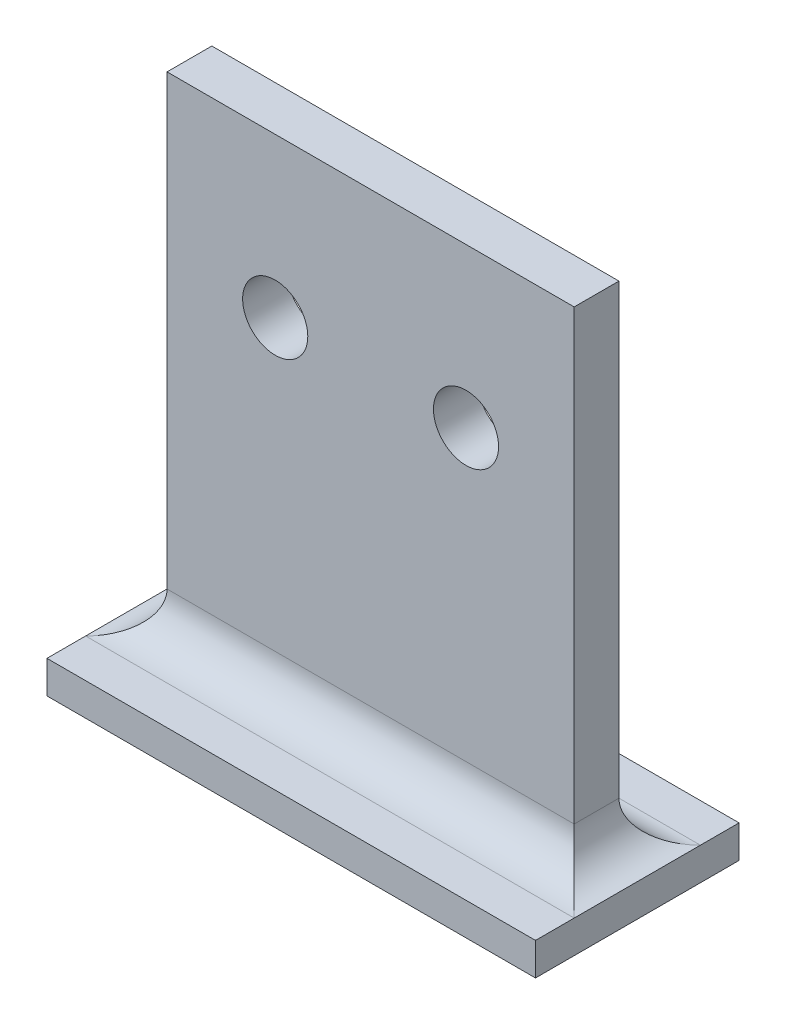
ISO-10303-21;
HEADER;
FILE_DESCRIPTION(('STEP AP214'),'2;1');
FILE_NAME('part.step','',(''),(''),'','','');
FILE_SCHEMA(('AUTOMOTIVE_DESIGN { 1 0 10303 214 1 1 1 1 }'));
ENDSEC;
DATA;
#1=APPLICATION_CONTEXT('core data for automotive mechanical design processes');
#2=APPLICATION_PROTOCOL_DEFINITION('international standard','automotive_design',2000,#1);
#3=PRODUCT_CONTEXT('',#1,'mechanical');
#4=PRODUCT('Part','Part','',(#3));
#5=PRODUCT_RELATED_PRODUCT_CATEGORY('part','',(#4));
#6=PRODUCT_DEFINITION_FORMATION('','',#4);
#7=PRODUCT_DEFINITION_CONTEXT('part definition',#1,'design');
#8=PRODUCT_DEFINITION('design','',#6,#7);
#9=PRODUCT_DEFINITION_SHAPE('','',#8);
#10=(LENGTH_UNIT() NAMED_UNIT(*) SI_UNIT(.MILLI.,.METRE.));
#11=(NAMED_UNIT(*) PLANE_ANGLE_UNIT() SI_UNIT($,.RADIAN.));
#12=(NAMED_UNIT(*) SI_UNIT($,.STERADIAN.) SOLID_ANGLE_UNIT());
#13=UNCERTAINTY_MEASURE_WITH_UNIT(LENGTH_MEASURE(1.E-05),#10,'distance_accuracy_value','');
#14=(GEOMETRIC_REPRESENTATION_CONTEXT(3) GLOBAL_UNCERTAINTY_ASSIGNED_CONTEXT((#13)) GLOBAL_UNIT_ASSIGNED_CONTEXT((#10,
#11,#12)) REPRESENTATION_CONTEXT('',''));
#15=CARTESIAN_POINT('',(0.,0.,0.));
#16=DIRECTION('',(0.,0.,1.));
#17=DIRECTION('',(1.,0.,0.));
#18=AXIS2_PLACEMENT_3D('',#15,#16,#17);
#19=CARTESIAN_POINT('',(-25.,62.8071570576541,9.75));
#20=DIRECTION('',(0.,0.,1.));
#21=DIRECTION('',(1.,0.,0.));
#22=AXIS2_PLACEMENT_3D('',#19,#20,#21);
#23=PLANE('',#22);
#24=DIRECTION('',(0.,-1.,0.));
#25=VECTOR('',#24,1.);
#26=CARTESIAN_POINT('',(25.,62.8071570576541,9.75));
#27=LINE('',#26,#25);
#28=CARTESIAN_POINT('',(25.,62.8071570576541,9.75));
#29=VERTEX_POINT('',#28);
#30=CARTESIAN_POINT('',(25.,7.80715705765408,9.75));
#31=VERTEX_POINT('',#30);
#32=EDGE_CURVE('E117',#29,#31,#27,.T.);
#33=ORIENTED_EDGE('',*,*,#32,.T.);
#34=DIRECTION('',(-1.,0.,0.));
#35=VECTOR('',#34,1.);
#36=CARTESIAN_POINT('',(-25.,7.80715705765408,9.75));
#37=LINE('',#36,#35);
#38=CARTESIAN_POINT('',(-25.,7.80715705765408,9.75));
#39=VERTEX_POINT('',#38);
#40=EDGE_CURVE('E175',#31,#39,#37,.T.);
#41=ORIENTED_EDGE('',*,*,#40,.T.);
#42=DIRECTION('',(0.,-1.,0.));
#43=VECTOR('',#42,1.);
#44=CARTESIAN_POINT('',(-25.,62.8071570576541,9.75));
#45=LINE('',#44,#43);
#46=CARTESIAN_POINT('',(-25.,62.8071570576541,9.75));
#47=VERTEX_POINT('',#46);
#48=EDGE_CURVE('E119',#47,#39,#45,.T.);
#49=ORIENTED_EDGE('',*,*,#48,.F.);
#50=DIRECTION('',(-1.,0.,0.));
#51=VECTOR('',#50,1.);
#52=CARTESIAN_POINT('',(-25.,62.8071570576541,9.75));
#53=LINE('',#52,#51);
#54=EDGE_CURVE('E112',#29,#47,#53,.T.);
#55=ORIENTED_EDGE('',*,*,#54,.F.);
#56=EDGE_LOOP('',(#33,#41,#49,#55));
#57=FACE_BOUND('',#56,.T.);
#58=CARTESIAN_POINT('',(11.715,43.3071570576541,9.75));
#59=DIRECTION('',(0.,0.,1.));
#60=DIRECTION('',(1.,0.,0.));
#61=AXIS2_PLACEMENT_3D('',#58,#59,#60);
#62=CIRCLE('',#61,4.);
#63=CARTESIAN_POINT('',(15.715,43.3071570576541,9.75));
#64=VERTEX_POINT('',#63);
#65=EDGE_CURVE('E312',#64,#64,#62,.F.);
#66=ORIENTED_EDGE('',*,*,#65,.F.);
#67=EDGE_LOOP('',(#66));
#68=FACE_BOUND('',#67,.T.);
#69=CARTESIAN_POINT('',(-11.715,43.3071570576541,9.75));
#70=DIRECTION('',(0.,0.,1.));
#71=DIRECTION('',(1.,0.,0.));
#72=AXIS2_PLACEMENT_3D('',#69,#70,#71);
#73=CIRCLE('',#72,4.);
#74=CARTESIAN_POINT('',(-7.71499999999999,43.3071570576541,9.75));
#75=VERTEX_POINT('',#74);
#76=EDGE_CURVE('E187',#75,#75,#73,.T.);
#77=ORIENTED_EDGE('',*,*,#76,.T.);
#78=EDGE_LOOP('',(#77));
#79=FACE_BOUND('',#78,.T.);
#80=ADVANCED_FACE('F33',(#57,#68,#79),#23,.F.);
#81=CARTESIAN_POINT('',(-25.,62.8071570576541,15.25));
#82=DIRECTION('',(0.,0.,-1.));
#83=DIRECTION('',(-1.,0.,0.));
#84=AXIS2_PLACEMENT_3D('',#81,#82,#83);
#85=PLANE('',#84);
#86=DIRECTION('',(0.,-1.,0.));
#87=VECTOR('',#86,1.);
#88=CARTESIAN_POINT('',(-25.,62.8071570576541,15.25));
#89=LINE('',#88,#87);
#90=CARTESIAN_POINT('',(-25.,62.8071570576541,15.25));
#91=VERTEX_POINT('',#90);
#92=CARTESIAN_POINT('',(-25.,7.80715705765408,15.25));
#93=VERTEX_POINT('',#92);
#94=EDGE_CURVE('E139',#91,#93,#89,.T.);
#95=ORIENTED_EDGE('',*,*,#94,.T.);
#96=DIRECTION('',(1.,0.,0.));
#97=VECTOR('',#96,1.);
#98=CARTESIAN_POINT('',(25.,7.80715705765408,15.25));
#99=LINE('',#98,#97);
#100=CARTESIAN_POINT('',(25.,7.80715705765408,15.25));
#101=VERTEX_POINT('',#100);
#102=EDGE_CURVE('E11',#93,#101,#99,.T.);
#103=ORIENTED_EDGE('',*,*,#102,.T.);
#104=DIRECTION('',(0.,-1.,0.));
#105=VECTOR('',#104,1.);
#106=CARTESIAN_POINT('',(25.,62.8071570576541,15.25));
#107=LINE('',#106,#105);
#108=CARTESIAN_POINT('',(25.,62.8071570576541,15.25));
#109=VERTEX_POINT('',#108);
#110=EDGE_CURVE('E302',#109,#101,#107,.T.);
#111=ORIENTED_EDGE('',*,*,#110,.F.);
#112=DIRECTION('',(1.,0.,0.));
#113=VECTOR('',#112,1.);
#114=CARTESIAN_POINT('',(-25.,62.8071570576541,15.25));
#115=LINE('',#114,#113);
#116=EDGE_CURVE('E128',#91,#109,#115,.T.);
#117=ORIENTED_EDGE('',*,*,#116,.F.);
#118=EDGE_LOOP('',(#95,#103,#111,#117));
#119=FACE_BOUND('',#118,.T.);
#120=CARTESIAN_POINT('',(11.715,43.3071570576541,15.25));
#121=DIRECTION('',(0.,0.,1.));
#122=DIRECTION('',(1.,0.,0.));
#123=AXIS2_PLACEMENT_3D('',#120,#121,#122);
#124=CIRCLE('',#123,4.);
#125=CARTESIAN_POINT('',(15.715,43.3071570576541,15.25));
#126=VERTEX_POINT('',#125);
#127=EDGE_CURVE('E309',#126,#126,#124,.F.);
#128=ORIENTED_EDGE('',*,*,#127,.T.);
#129=EDGE_LOOP('',(#128));
#130=FACE_BOUND('',#129,.T.);
#131=CARTESIAN_POINT('',(-11.715,43.3071570576541,15.25));
#132=DIRECTION('',(0.,0.,1.));
#133=DIRECTION('',(1.,0.,0.));
#134=AXIS2_PLACEMENT_3D('',#131,#132,#133);
#135=CIRCLE('',#134,4.);
#136=CARTESIAN_POINT('',(-7.71499999999999,43.3071570576541,15.25));
#137=VERTEX_POINT('',#136);
#138=EDGE_CURVE('E311',#137,#137,#135,.T.);
#139=ORIENTED_EDGE('',*,*,#138,.F.);
#140=EDGE_LOOP('',(#139));
#141=FACE_BOUND('',#140,.T.);
#142=ADVANCED_FACE('F236',(#119,#130,#141),#85,.F.);
#143=CARTESIAN_POINT('',(30.,2.80715705765408,25.));
#144=DIRECTION('',(0.,-1.,0.));
#145=DIRECTION('',(0.,0.,-1.));
#146=AXIS2_PLACEMENT_3D('',#143,#144,#145);
#147=PLANE('',#146);
#148=DIRECTION('',(0.,0.,-1.));
#149=VECTOR('',#148,1.);
#150=CARTESIAN_POINT('',(-30.,2.80715705765408,25.));
#151=LINE('',#150,#149);
#152=CARTESIAN_POINT('',(-30.,2.80715705765408,4.75));
#153=VERTEX_POINT('',#152);
#154=CARTESIAN_POINT('',(-30.,2.80715705765408,0.));
#155=VERTEX_POINT('',#154);
#156=EDGE_CURVE('E152',#153,#155,#151,.T.);
#157=ORIENTED_EDGE('',*,*,#156,.F.);
#158=DIRECTION('',(-1.,0.,0.));
#159=VECTOR('',#158,1.);
#160=CARTESIAN_POINT('',(25.,2.80715705765408,4.75));
#161=LINE('',#160,#159);
#162=CARTESIAN_POINT('',(30.,2.80715705765408,4.75));
#163=VERTEX_POINT('',#162);
#164=EDGE_CURVE('E179',#153,#163,#161,.F.);
#165=ORIENTED_EDGE('',*,*,#164,.T.);
#166=DIRECTION('',(0.,0.,-1.));
#167=VECTOR('',#166,1.);
#168=CARTESIAN_POINT('',(30.,2.80715705765408,25.));
#169=LINE('',#168,#167);
#170=CARTESIAN_POINT('',(30.,2.80715705765408,0.));
#171=VERTEX_POINT('',#170);
#172=EDGE_CURVE('E163',#163,#171,#169,.T.);
#173=ORIENTED_EDGE('',*,*,#172,.T.);
#174=DIRECTION('',(-1.,0.,0.));
#175=VECTOR('',#174,1.);
#176=CARTESIAN_POINT('',(30.,2.80715705765408,0.));
#177=LINE('',#176,#175);
#178=EDGE_CURVE('E147',#171,#155,#177,.T.);
#179=ORIENTED_EDGE('',*,*,#178,.T.);
#180=EDGE_LOOP('',(#157,#165,#173,#179));
#181=FACE_BOUND('',#180,.T.);
#182=ADVANCED_FACE('F219',(#181),#147,.F.);
#183=CARTESIAN_POINT('',(30.,2.80715705765408,25.));
#184=VERTEX_POINT('',#183);
#185=CARTESIAN_POINT('',(30.,2.80715705765408,20.25));
#186=VERTEX_POINT('',#185);
#187=EDGE_CURVE('E165',#184,#186,#169,.T.);
#188=ORIENTED_EDGE('',*,*,#187,.T.);
#189=DIRECTION('',(1.,0.,0.));
#190=VECTOR('',#189,1.);
#191=CARTESIAN_POINT('',(-25.,2.80715705765408,20.25));
#192=LINE('',#191,#190);
#193=CARTESIAN_POINT('',(-30.,2.80715705765408,20.25));
#194=VERTEX_POINT('',#193);
#195=EDGE_CURVE('E177',#186,#194,#192,.F.);
#196=ORIENTED_EDGE('',*,*,#195,.T.);
#197=CARTESIAN_POINT('',(-30.,2.80715705765408,25.));
#198=VERTEX_POINT('',#197);
#199=EDGE_CURVE('E160',#198,#194,#151,.T.);
#200=ORIENTED_EDGE('',*,*,#199,.F.);
#201=DIRECTION('',(-1.,0.,0.));
#202=VECTOR('',#201,1.);
#203=CARTESIAN_POINT('',(30.,2.80715705765408,25.));
#204=LINE('',#203,#202);
#205=EDGE_CURVE('E151',#184,#198,#204,.T.);
#206=ORIENTED_EDGE('',*,*,#205,.F.);
#207=EDGE_LOOP('',(#188,#196,#200,#206));
#208=FACE_BOUND('',#207,.T.);
#209=ADVANCED_FACE('F202',(#208),#147,.F.);
#210=CARTESIAN_POINT('',(-30.,-1.19284294234592,25.));
#211=DIRECTION('',(1.,0.,0.));
#212=DIRECTION('',(0.,0.,-1.));
#213=AXIS2_PLACEMENT_3D('',#210,#211,#212);
#214=PLANE('',#213);
#215=DIRECTION('',(0.,-1.,0.));
#216=VECTOR('',#215,1.);
#217=CARTESIAN_POINT('',(-30.,-1.19284294234592,0.));
#218=LINE('',#217,#216);
#219=CARTESIAN_POINT('',(-30.,-1.19284294234592,0.));
#220=VERTEX_POINT('',#219);
#221=EDGE_CURVE('E134',#155,#220,#218,.T.);
#222=ORIENTED_EDGE('',*,*,#221,.T.);
#223=DIRECTION('',(0.,0.,-1.));
#224=VECTOR('',#223,1.);
#225=CARTESIAN_POINT('',(-30.,-1.19284294234592,25.));
#226=LINE('',#225,#224);
#227=CARTESIAN_POINT('',(-30.,-1.19284294234592,25.));
#228=VERTEX_POINT('',#227);
#229=EDGE_CURVE('E172',#228,#220,#226,.T.);
#230=ORIENTED_EDGE('',*,*,#229,.F.);
#231=DIRECTION('',(0.,-1.,0.));
#232=VECTOR('',#231,1.);
#233=CARTESIAN_POINT('',(-30.,-1.19284294234592,25.));
#234=LINE('',#233,#232);
#235=EDGE_CURVE('E143',#198,#228,#234,.T.);
#236=ORIENTED_EDGE('',*,*,#235,.F.);
#237=ORIENTED_EDGE('',*,*,#199,.T.);
#238=EDGE_CURVE('E164',#194,#153,#151,.T.);
#239=ORIENTED_EDGE('',*,*,#238,.T.);
#240=ORIENTED_EDGE('',*,*,#156,.T.);
#241=EDGE_LOOP('',(#222,#230,#236,#237,#239,#240));
#242=FACE_BOUND('',#241,.T.);
#243=ADVANCED_FACE('F208',(#242),#214,.F.);
#244=CARTESIAN_POINT('',(30.,-1.19284294234592,25.));
#245=DIRECTION('',(0.,1.,0.));
#246=DIRECTION('',(0.,0.,1.));
#247=AXIS2_PLACEMENT_3D('',#244,#245,#246);
#248=PLANE('',#247);
#249=DIRECTION('',(1.,0.,0.));
#250=VECTOR('',#249,1.);
#251=CARTESIAN_POINT('',(30.,-1.19284294234592,0.));
#252=LINE('',#251,#250);
#253=CARTESIAN_POINT('',(30.,-1.19284294234592,0.));
#254=VERTEX_POINT('',#253);
#255=EDGE_CURVE('E137',#220,#254,#252,.T.);
#256=ORIENTED_EDGE('',*,*,#255,.T.);
#257=DIRECTION('',(0.,0.,-1.));
#258=VECTOR('',#257,1.);
#259=CARTESIAN_POINT('',(30.,-1.19284294234592,25.));
#260=LINE('',#259,#258);
#261=CARTESIAN_POINT('',(30.,-1.19284294234592,25.));
#262=VERTEX_POINT('',#261);
#263=EDGE_CURVE('E168',#262,#254,#260,.T.);
#264=ORIENTED_EDGE('',*,*,#263,.F.);
#265=DIRECTION('',(1.,0.,0.));
#266=VECTOR('',#265,1.);
#267=CARTESIAN_POINT('',(30.,-1.19284294234592,25.));
#268=LINE('',#267,#266);
#269=EDGE_CURVE('E146',#228,#262,#268,.T.);
#270=ORIENTED_EDGE('',*,*,#269,.F.);
#271=ORIENTED_EDGE('',*,*,#229,.T.);
#272=EDGE_LOOP('',(#256,#264,#270,#271));
#273=FACE_BOUND('',#272,.T.);
#274=ADVANCED_FACE('F226',(#273),#248,.F.);
#275=CARTESIAN_POINT('',(30.,-1.19284294234592,25.));
#276=DIRECTION('',(-1.,0.,0.));
#277=DIRECTION('',(0.,0.,1.));
#278=AXIS2_PLACEMENT_3D('',#275,#276,#277);
#279=PLANE('',#278);
#280=DIRECTION('',(0.,1.,0.));
#281=VECTOR('',#280,1.);
#282=CARTESIAN_POINT('',(30.,-1.19284294234592,0.));
#283=LINE('',#282,#281);
#284=EDGE_CURVE('E155',#254,#171,#283,.T.);
#285=ORIENTED_EDGE('',*,*,#284,.T.);
#286=ORIENTED_EDGE('',*,*,#172,.F.);
#287=EDGE_CURVE('E169',#186,#163,#169,.T.);
#288=ORIENTED_EDGE('',*,*,#287,.F.);
#289=ORIENTED_EDGE('',*,*,#187,.F.);
#290=DIRECTION('',(0.,1.,0.));
#291=VECTOR('',#290,1.);
#292=CARTESIAN_POINT('',(30.,-1.19284294234592,25.));
#293=LINE('',#292,#291);
#294=EDGE_CURVE('E149',#262,#184,#293,.T.);
#295=ORIENTED_EDGE('',*,*,#294,.F.);
#296=ORIENTED_EDGE('',*,*,#263,.T.);
#297=EDGE_LOOP('',(#285,#286,#288,#289,#295,#296));
#298=FACE_BOUND('',#297,.T.);
#299=ADVANCED_FACE('F216',(#298),#279,.F.);
#300=CARTESIAN_POINT('',(0.,0.,25.));
#301=DIRECTION('',(0.,0.,1.));
#302=DIRECTION('',(1.,0.,0.));
#303=AXIS2_PLACEMENT_3D('',#300,#301,#302);
#304=PLANE('',#303);
#305=ORIENTED_EDGE('',*,*,#235,.T.);
#306=ORIENTED_EDGE('',*,*,#269,.T.);
#307=ORIENTED_EDGE('',*,*,#294,.T.);
#308=ORIENTED_EDGE('',*,*,#205,.T.);
#309=EDGE_LOOP('',(#305,#306,#307,#308));
#310=FACE_BOUND('',#309,.T.);
#311=ADVANCED_FACE('F212',(#310),#304,.T.);
#312=CARTESIAN_POINT('',(0.,0.,0.));
#313=DIRECTION('',(0.,0.,1.));
#314=DIRECTION('',(1.,0.,0.));
#315=AXIS2_PLACEMENT_3D('',#312,#313,#314);
#316=PLANE('',#315);
#317=ORIENTED_EDGE('',*,*,#221,.F.);
#318=ORIENTED_EDGE('',*,*,#178,.F.);
#319=ORIENTED_EDGE('',*,*,#284,.F.);
#320=ORIENTED_EDGE('',*,*,#255,.F.);
#321=EDGE_LOOP('',(#317,#318,#319,#320));
#322=FACE_BOUND('',#321,.T.);
#323=ADVANCED_FACE('F224',(#322),#316,.F.);
#324=CARTESIAN_POINT('',(25.,62.8071570576541,9.75));
#325=DIRECTION('',(-1.,0.,0.));
#326=DIRECTION('',(0.,0.,1.));
#327=AXIS2_PLACEMENT_3D('',#324,#325,#326);
#328=PLANE('',#327);
#329=ORIENTED_EDGE('',*,*,#110,.T.);
#330=DIRECTION('',(0.,0.,-1.));
#331=VECTOR('',#330,1.);
#332=CARTESIAN_POINT('',(25.,7.80715705765408,9.75));
#333=LINE('',#332,#331);
#334=EDGE_CURVE('E133',#101,#31,#333,.T.);
#335=ORIENTED_EDGE('',*,*,#334,.T.);
#336=ORIENTED_EDGE('',*,*,#32,.F.);
#337=DIRECTION('',(0.,0.,-1.));
#338=VECTOR('',#337,1.);
#339=CARTESIAN_POINT('',(25.,62.8071570576541,9.75));
#340=LINE('',#339,#338);
#341=EDGE_CURVE('E123',#109,#29,#340,.T.);
#342=ORIENTED_EDGE('',*,*,#341,.F.);
#343=EDGE_LOOP('',(#329,#335,#336,#342));
#344=FACE_BOUND('',#343,.T.);
#345=ADVANCED_FACE('F131',(#344),#328,.F.);
#346=CARTESIAN_POINT('',(-25.,62.8071570576541,9.75));
#347=DIRECTION('',(1.,0.,0.));
#348=DIRECTION('',(0.,0.,-1.));
#349=AXIS2_PLACEMENT_3D('',#346,#347,#348);
#350=PLANE('',#349);
#351=ORIENTED_EDGE('',*,*,#48,.T.);
#352=DIRECTION('',(0.,0.,1.));
#353=VECTOR('',#352,1.);
#354=CARTESIAN_POINT('',(-25.,7.80715705765408,15.25));
#355=LINE('',#354,#353);
#356=EDGE_CURVE('E42',#39,#93,#355,.T.);
#357=ORIENTED_EDGE('',*,*,#356,.T.);
#358=ORIENTED_EDGE('',*,*,#94,.F.);
#359=DIRECTION('',(0.,0.,1.));
#360=VECTOR('',#359,1.);
#361=CARTESIAN_POINT('',(-25.,62.8071570576541,9.75));
#362=LINE('',#361,#360);
#363=EDGE_CURVE('E122',#47,#91,#362,.T.);
#364=ORIENTED_EDGE('',*,*,#363,.F.);
#365=EDGE_LOOP('',(#351,#357,#358,#364));
#366=FACE_BOUND('',#365,.T.);
#367=ADVANCED_FACE('F244',(#366),#350,.F.);
#368=CARTESIAN_POINT('',(0.,62.8071570576541,0.));
#369=DIRECTION('',(0.,1.,0.));
#370=DIRECTION('',(0.,0.,1.));
#371=AXIS2_PLACEMENT_3D('',#368,#369,#370);
#372=PLANE('',#371);
#373=ORIENTED_EDGE('',*,*,#341,.T.);
#374=ORIENTED_EDGE('',*,*,#54,.T.);
#375=ORIENTED_EDGE('',*,*,#363,.T.);
#376=ORIENTED_EDGE('',*,*,#116,.T.);
#377=EDGE_LOOP('',(#373,#374,#375,#376));
#378=FACE_BOUND('',#377,.T.);
#379=ADVANCED_FACE('F126',(#378),#372,.T.);
#380=CARTESIAN_POINT('',(-25.,7.80715705765408,20.25));
#381=DIRECTION('',(-1.,0.,0.));
#382=DIRECTION('',(0.,0.,1.));
#383=AXIS2_PLACEMENT_3D('',#380,#381,#382);
#384=CYLINDRICAL_SURFACE('',#383,5.);
#385=CARTESIAN_POINT('',(-30.,7.80715705765408,20.25));
#386=DIRECTION('',(-0.707106781186547,0.,-0.707106781186547));
#387=DIRECTION('',(-0.707106781186547,0.,0.707106781186547));
#388=AXIS2_PLACEMENT_3D('',#385,#386,#387);
#389=ELLIPSE('',#388,7.07106781186547,5.);
#390=EDGE_CURVE('E188',#194,#93,#389,.F.);
#391=ORIENTED_EDGE('',*,*,#390,.F.);
#392=ORIENTED_EDGE('',*,*,#195,.F.);
#393=CARTESIAN_POINT('',(30.,7.80715705765408,20.25));
#394=DIRECTION('',(-0.707106781186547,0.,0.707106781186547));
#395=DIRECTION('',(-0.707106781186547,0.,-0.707106781186547));
#396=AXIS2_PLACEMENT_3D('',#393,#394,#395);
#397=ELLIPSE('',#396,7.07106781186547,5.);
#398=EDGE_CURVE('E37',#101,#186,#397,.T.);
#399=ORIENTED_EDGE('',*,*,#398,.F.);
#400=ORIENTED_EDGE('',*,*,#102,.F.);
#401=EDGE_LOOP('',(#391,#392,#399,#400));
#402=FACE_BOUND('',#401,.T.);
#403=ADVANCED_FACE('F35',(#402),#384,.F.);
#404=CARTESIAN_POINT('',(30.,7.80715705765408,9.75));
#405=DIRECTION('',(0.,0.,1.));
#406=DIRECTION('',(1.,0.,0.));
#407=AXIS2_PLACEMENT_3D('',#404,#405,#406);
#408=CYLINDRICAL_SURFACE('',#407,5.);
#409=ORIENTED_EDGE('',*,*,#398,.T.);
#410=ORIENTED_EDGE('',*,*,#287,.T.);
#411=CARTESIAN_POINT('',(30.,7.80715705765408,4.75));
#412=DIRECTION('',(0.707106781186547,0.,0.707106781186547));
#413=DIRECTION('',(-0.707106781186547,0.,0.707106781186547));
#414=AXIS2_PLACEMENT_3D('',#411,#412,#413);
#415=ELLIPSE('',#414,7.07106781186547,5.);
#416=EDGE_CURVE('E186',#31,#163,#415,.T.);
#417=ORIENTED_EDGE('',*,*,#416,.F.);
#418=ORIENTED_EDGE('',*,*,#334,.F.);
#419=EDGE_LOOP('',(#409,#410,#417,#418));
#420=FACE_BOUND('',#419,.T.);
#421=ADVANCED_FACE('F197',(#420),#408,.F.);
#422=CARTESIAN_POINT('',(-30.,7.80715705765408,9.75));
#423=DIRECTION('',(0.,0.,-1.));
#424=DIRECTION('',(-1.,0.,0.));
#425=AXIS2_PLACEMENT_3D('',#422,#423,#424);
#426=CYLINDRICAL_SURFACE('',#425,5.);
#427=ORIENTED_EDGE('',*,*,#390,.T.);
#428=ORIENTED_EDGE('',*,*,#356,.F.);
#429=CARTESIAN_POINT('',(-30.,7.80715705765408,4.75));
#430=DIRECTION('',(0.707106781186547,0.,-0.707106781186547));
#431=DIRECTION('',(-0.707106781186547,0.,-0.707106781186547));
#432=AXIS2_PLACEMENT_3D('',#429,#430,#431);
#433=ELLIPSE('',#432,7.07106781186547,5.);
#434=EDGE_CURVE('E184',#153,#39,#433,.F.);
#435=ORIENTED_EDGE('',*,*,#434,.F.);
#436=ORIENTED_EDGE('',*,*,#238,.F.);
#437=EDGE_LOOP('',(#427,#428,#435,#436));
#438=FACE_BOUND('',#437,.T.);
#439=ADVANCED_FACE('F377',(#438),#426,.F.);
#440=CARTESIAN_POINT('',(-25.,7.80715705765408,4.75));
#441=DIRECTION('',(1.,0.,0.));
#442=DIRECTION('',(0.,0.,-1.));
#443=AXIS2_PLACEMENT_3D('',#440,#441,#442);
#444=CYLINDRICAL_SURFACE('',#443,5.);
#445=ORIENTED_EDGE('',*,*,#416,.T.);
#446=ORIENTED_EDGE('',*,*,#164,.F.);
#447=ORIENTED_EDGE('',*,*,#434,.T.);
#448=ORIENTED_EDGE('',*,*,#40,.F.);
#449=EDGE_LOOP('',(#445,#446,#447,#448));
#450=FACE_BOUND('',#449,.T.);
#451=ADVANCED_FACE('F277',(#450),#444,.F.);
#452=CARTESIAN_POINT('',(11.715,43.3071570576541,-44.75));
#453=DIRECTION('',(0.,0.,1.));
#454=DIRECTION('',(1.,0.,0.));
#455=AXIS2_PLACEMENT_3D('',#452,#453,#454);
#456=CYLINDRICAL_SURFACE('',#455,4.);
#457=ORIENTED_EDGE('',*,*,#127,.F.);
#458=EDGE_LOOP('',(#457));
#459=FACE_BOUND('',#458,.T.);
#460=ORIENTED_EDGE('',*,*,#65,.T.);
#461=EDGE_LOOP('',(#460));
#462=FACE_BOUND('',#461,.T.);
#463=ADVANCED_FACE('F271',(#459,#462),#456,.F.);
#464=CARTESIAN_POINT('',(-11.715,43.3071570576541,-44.75));
#465=DIRECTION('',(0.,0.,1.));
#466=DIRECTION('',(1.,0.,0.));
#467=AXIS2_PLACEMENT_3D('',#464,#465,#466);
#468=CYLINDRICAL_SURFACE('',#467,4.);
#469=ORIENTED_EDGE('',*,*,#138,.T.);
#470=EDGE_LOOP('',(#469));
#471=FACE_BOUND('',#470,.T.);
#472=ORIENTED_EDGE('',*,*,#76,.F.);
#473=EDGE_LOOP('',(#472));
#474=FACE_BOUND('',#473,.T.);
#475=ADVANCED_FACE('F276',(#471,#474),#468,.F.);
#476=CLOSED_SHELL('',(#80,#142,#182,#209,#243,#274,#299,#311,#323,#345,#367,#379,#403,#421,#439,
#451,#463,#475));
#477=MANIFOLD_SOLID_BREP('B2',#476);
#478=ADVANCED_BREP_SHAPE_REPRESENTATION('',(#18,#477),#14);
#479=SHAPE_DEFINITION_REPRESENTATION(#9,#478);
ENDSEC;
END-ISO-10303-21;
